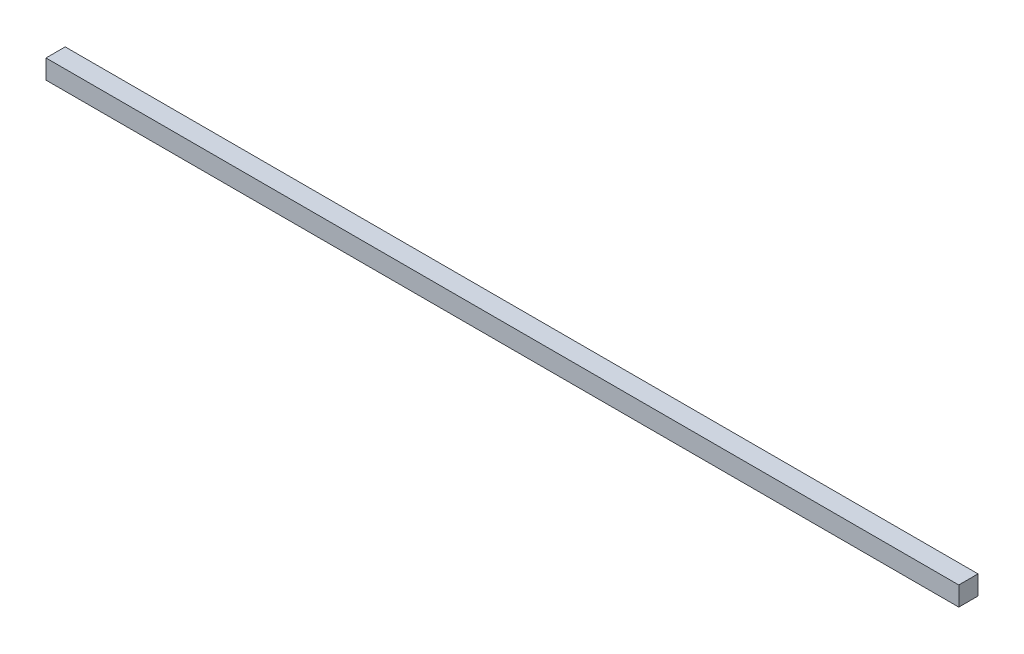
ISO-10303-21;
HEADER;
FILE_DESCRIPTION(('STEP AP214'),'2;1');
FILE_NAME('part.step','',(''),(''),'','','');
FILE_SCHEMA(('AUTOMOTIVE_DESIGN { 1 0 10303 214 1 1 1 1 }'));
ENDSEC;
DATA;
#1=APPLICATION_CONTEXT('core data for automotive mechanical design processes');
#2=APPLICATION_PROTOCOL_DEFINITION('international standard','automotive_design',2000,#1);
#3=PRODUCT_CONTEXT('',#1,'mechanical');
#4=PRODUCT('Part','Part','',(#3));
#5=PRODUCT_RELATED_PRODUCT_CATEGORY('part','',(#4));
#6=PRODUCT_DEFINITION_FORMATION('','',#4);
#7=PRODUCT_DEFINITION_CONTEXT('part definition',#1,'design');
#8=PRODUCT_DEFINITION('design','',#6,#7);
#9=PRODUCT_DEFINITION_SHAPE('','',#8);
#10=(LENGTH_UNIT() NAMED_UNIT(*) SI_UNIT(.MILLI.,.METRE.));
#11=(NAMED_UNIT(*) PLANE_ANGLE_UNIT() SI_UNIT($,.RADIAN.));
#12=(NAMED_UNIT(*) SI_UNIT($,.STERADIAN.) SOLID_ANGLE_UNIT());
#13=UNCERTAINTY_MEASURE_WITH_UNIT(LENGTH_MEASURE(1.E-05),#10,'distance_accuracy_value','');
#14=(GEOMETRIC_REPRESENTATION_CONTEXT(3) GLOBAL_UNCERTAINTY_ASSIGNED_CONTEXT((#13)) GLOBAL_UNIT_ASSIGNED_CONTEXT((#10,
#11,#12)) REPRESENTATION_CONTEXT('',''));
#15=CARTESIAN_POINT('',(0.,0.,0.));
#16=DIRECTION('',(0.,0.,1.));
#17=DIRECTION('',(1.,0.,0.));
#18=AXIS2_PLACEMENT_3D('',#15,#16,#17);
#19=CARTESIAN_POINT('',(950.,-20.0000000000002,0.));
#20=DIRECTION('',(0.,1.,0.));
#21=DIRECTION('',(0.,0.,1.));
#22=AXIS2_PLACEMENT_3D('',#19,#20,#21);
#23=PLANE('',#22);
#24=DIRECTION('',(1.,0.,0.));
#25=VECTOR('',#24,1.);
#26=CARTESIAN_POINT('',(950.,-20.,-20.));
#27=LINE('',#26,#25);
#28=CARTESIAN_POINT('',(0.,-20.,-20.));
#29=VERTEX_POINT('',#28);
#30=CARTESIAN_POINT('',(1900.,-20.0000000000001,-20.));
#31=VERTEX_POINT('',#30);
#32=EDGE_CURVE('E73',#29,#31,#27,.T.);
#33=ORIENTED_EDGE('',*,*,#32,.T.);
#34=DIRECTION('',(0.,0.,1.));
#35=VECTOR('',#34,1.);
#36=CARTESIAN_POINT('',(1900.,-20.0000000000003,0.));
#37=LINE('',#36,#35);
#38=CARTESIAN_POINT('',(1900.,-20.0000000000001,20.));
#39=VERTEX_POINT('',#38);
#40=EDGE_CURVE('E55',#31,#39,#37,.T.);
#41=ORIENTED_EDGE('',*,*,#40,.T.);
#42=DIRECTION('',(1.,0.,0.));
#43=VECTOR('',#42,1.);
#44=CARTESIAN_POINT('',(950.,-20.,20.));
#45=LINE('',#44,#43);
#46=CARTESIAN_POINT('',(0.,-20.,20.));
#47=VERTEX_POINT('',#46);
#48=EDGE_CURVE('E17',#47,#39,#45,.T.);
#49=ORIENTED_EDGE('',*,*,#48,.F.);
#50=DIRECTION('',(0.,0.,1.));
#51=VECTOR('',#50,1.);
#52=CARTESIAN_POINT('',(0.,-20.,0.));
#53=LINE('',#52,#51);
#54=EDGE_CURVE('E52',#47,#29,#53,.F.);
#55=ORIENTED_EDGE('',*,*,#54,.T.);
#56=EDGE_LOOP('',(#33,#41,#49,#55));
#57=FACE_BOUND('',#56,.T.);
#58=ADVANCED_FACE('F14',(#57),#23,.F.);
#59=CARTESIAN_POINT('',(950.,-1.74506405419689E-13,20.));
#60=DIRECTION('',(0.,0.,1.));
#61=DIRECTION('',(1.,0.,0.));
#62=AXIS2_PLACEMENT_3D('',#59,#60,#61);
#63=PLANE('',#62);
#64=DIRECTION('',(1.,0.,0.));
#65=VECTOR('',#64,1.);
#66=CARTESIAN_POINT('',(950.,19.9999999999998,20.));
#67=LINE('',#66,#65);
#68=CARTESIAN_POINT('',(1900.,19.9999999999997,20.));
#69=VERTEX_POINT('',#68);
#70=CARTESIAN_POINT('',(0.,19.9999999999998,20.));
#71=VERTEX_POINT('',#70);
#72=EDGE_CURVE('E70',#69,#71,#67,.F.);
#73=ORIENTED_EDGE('',*,*,#72,.T.);
#74=DIRECTION('',(0.,1.,0.));
#75=VECTOR('',#74,1.);
#76=CARTESIAN_POINT('',(0.,0.,20.));
#77=LINE('',#76,#75);
#78=EDGE_CURVE('E60',#71,#47,#77,.F.);
#79=ORIENTED_EDGE('',*,*,#78,.T.);
#80=ORIENTED_EDGE('',*,*,#48,.T.);
#81=DIRECTION('',(0.,-1.,0.));
#82=VECTOR('',#81,1.);
#83=CARTESIAN_POINT('',(1900.,-3.49012810839378E-13,20.));
#84=LINE('',#83,#82);
#85=EDGE_CURVE('E75',#39,#69,#84,.F.);
#86=ORIENTED_EDGE('',*,*,#85,.T.);
#87=EDGE_LOOP('',(#73,#79,#80,#86));
#88=FACE_BOUND('',#87,.T.);
#89=ADVANCED_FACE('F69',(#88),#63,.T.);
#90=CARTESIAN_POINT('',(0.,0.,0.));
#91=DIRECTION('',(1.,0.,0.));
#92=DIRECTION('',(0.,1.,0.));
#93=AXIS2_PLACEMENT_3D('',#90,#91,#92);
#94=PLANE('',#93);
#95=DIRECTION('',(0.,1.,0.));
#96=VECTOR('',#95,1.);
#97=CARTESIAN_POINT('',(0.,-1.74506405419689E-13,-20.));
#98=LINE('',#97,#96);
#99=CARTESIAN_POINT('',(0.,19.9999999999999,-20.));
#100=VERTEX_POINT('',#99);
#101=EDGE_CURVE('E66',#100,#29,#98,.F.);
#102=ORIENTED_EDGE('',*,*,#101,.T.);
#103=ORIENTED_EDGE('',*,*,#54,.F.);
#104=ORIENTED_EDGE('',*,*,#78,.F.);
#105=DIRECTION('',(0.,0.,1.));
#106=VECTOR('',#105,1.);
#107=CARTESIAN_POINT('',(0.,20.,0.));
#108=LINE('',#107,#106);
#109=EDGE_CURVE('E80',#71,#100,#108,.F.);
#110=ORIENTED_EDGE('',*,*,#109,.T.);
#111=EDGE_LOOP('',(#102,#103,#104,#110));
#112=FACE_BOUND('',#111,.T.);
#113=ADVANCED_FACE('F63',(#112),#94,.F.);
#114=CARTESIAN_POINT('',(950.,-1.74506405419689E-13,-20.));
#115=DIRECTION('',(0.,0.,1.));
#116=DIRECTION('',(1.,0.,0.));
#117=AXIS2_PLACEMENT_3D('',#114,#115,#116);
#118=PLANE('',#117);
#119=ORIENTED_EDGE('',*,*,#101,.F.);
#120=DIRECTION('',(1.,0.,0.));
#121=VECTOR('',#120,1.);
#122=CARTESIAN_POINT('',(950.,19.9999999999998,-20.));
#123=LINE('',#122,#121);
#124=CARTESIAN_POINT('',(1900.,19.9999999999997,-20.));
#125=VERTEX_POINT('',#124);
#126=EDGE_CURVE('E23',#100,#125,#123,.T.);
#127=ORIENTED_EDGE('',*,*,#126,.T.);
#128=DIRECTION('',(0.,-1.,0.));
#129=VECTOR('',#128,1.);
#130=CARTESIAN_POINT('',(1900.,-3.49012810839378E-13,-20.));
#131=LINE('',#130,#129);
#132=EDGE_CURVE('E31',#125,#31,#131,.T.);
#133=ORIENTED_EDGE('',*,*,#132,.T.);
#134=ORIENTED_EDGE('',*,*,#32,.F.);
#135=EDGE_LOOP('',(#119,#127,#133,#134));
#136=FACE_BOUND('',#135,.T.);
#137=ADVANCED_FACE('F85',(#136),#118,.F.);
#138=CARTESIAN_POINT('',(1900.,-3.49012810839378E-13,0.));
#139=DIRECTION('',(-1.,0.,0.));
#140=DIRECTION('',(0.,-1.,0.));
#141=AXIS2_PLACEMENT_3D('',#138,#139,#140);
#142=PLANE('',#141);
#143=ORIENTED_EDGE('',*,*,#132,.F.);
#144=DIRECTION('',(0.,0.,1.));
#145=VECTOR('',#144,1.);
#146=CARTESIAN_POINT('',(1900.,19.9999999999997,0.));
#147=LINE('',#146,#145);
#148=EDGE_CURVE('E9',#125,#69,#147,.T.);
#149=ORIENTED_EDGE('',*,*,#148,.T.);
#150=ORIENTED_EDGE('',*,*,#85,.F.);
#151=ORIENTED_EDGE('',*,*,#40,.F.);
#152=EDGE_LOOP('',(#143,#149,#150,#151));
#153=FACE_BOUND('',#152,.T.);
#154=ADVANCED_FACE('F88',(#153),#142,.F.);
#155=CARTESIAN_POINT('',(950.,19.9999999999998,0.));
#156=DIRECTION('',(0.,-1.,0.));
#157=DIRECTION('',(1.,0.,0.));
#158=AXIS2_PLACEMENT_3D('',#155,#156,#157);
#159=PLANE('',#158);
#160=ORIENTED_EDGE('',*,*,#126,.F.);
#161=ORIENTED_EDGE('',*,*,#109,.F.);
#162=ORIENTED_EDGE('',*,*,#72,.F.);
#163=ORIENTED_EDGE('',*,*,#148,.F.);
#164=EDGE_LOOP('',(#160,#161,#162,#163));
#165=FACE_BOUND('',#164,.T.);
#166=ADVANCED_FACE('F87',(#165),#159,.F.);
#167=CLOSED_SHELL('',(#58,#89,#113,#137,#154,#166));
#168=MANIFOLD_SOLID_BREP('B1',#167);
#169=ADVANCED_BREP_SHAPE_REPRESENTATION('',(#18,#168),#14);
#170=SHAPE_DEFINITION_REPRESENTATION(#9,#169);
ENDSEC;
END-ISO-10303-21;
